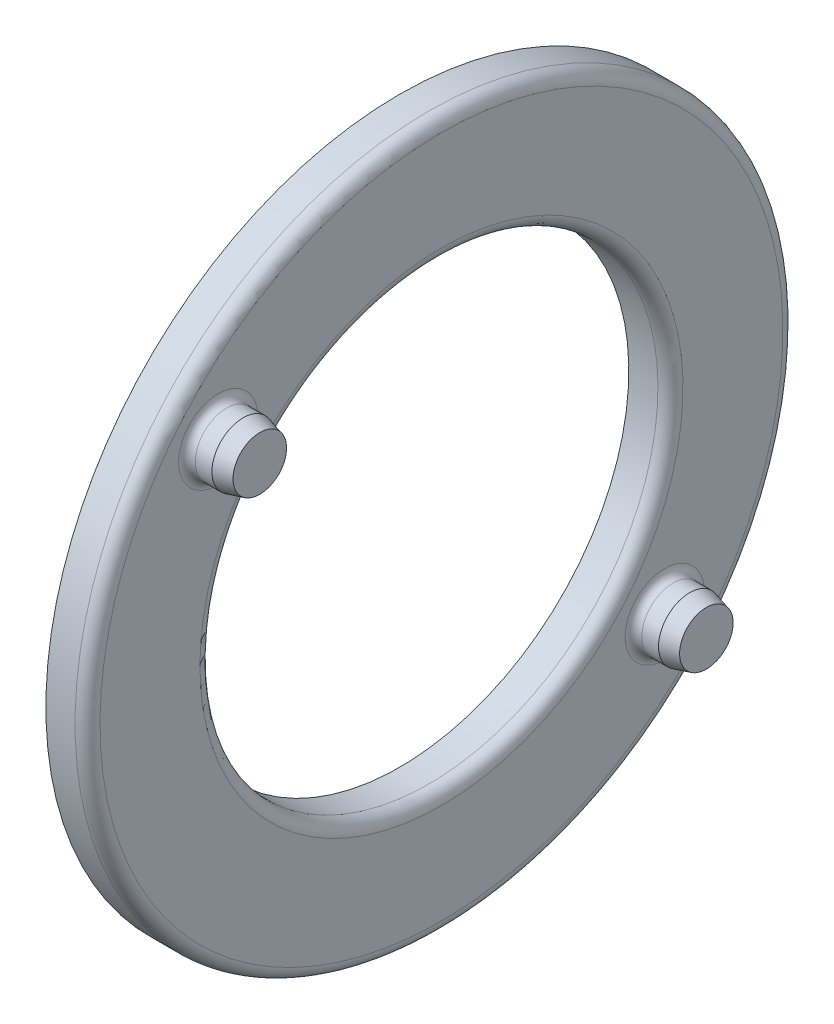
ISO-10303-21;
HEADER;
FILE_DESCRIPTION(('STEP AP214'),'2;1');
FILE_NAME('part.step','',(''),(''),'','','');
FILE_SCHEMA(('AUTOMOTIVE_DESIGN { 1 0 10303 214 1 1 1 1 }'));
ENDSEC;
DATA;
#1=APPLICATION_CONTEXT('core data for automotive mechanical design processes');
#2=APPLICATION_PROTOCOL_DEFINITION('international standard','automotive_design',2000,#1);
#3=PRODUCT_CONTEXT('',#1,'mechanical');
#4=PRODUCT('Part','Part','',(#3));
#5=PRODUCT_RELATED_PRODUCT_CATEGORY('part','',(#4));
#6=PRODUCT_DEFINITION_FORMATION('','',#4);
#7=PRODUCT_DEFINITION_CONTEXT('part definition',#1,'design');
#8=PRODUCT_DEFINITION('design','',#6,#7);
#9=PRODUCT_DEFINITION_SHAPE('','',#8);
#10=(LENGTH_UNIT() NAMED_UNIT(*) SI_UNIT(.MILLI.,.METRE.));
#11=(NAMED_UNIT(*) PLANE_ANGLE_UNIT() SI_UNIT($,.RADIAN.));
#12=(NAMED_UNIT(*) SI_UNIT($,.STERADIAN.) SOLID_ANGLE_UNIT());
#13=UNCERTAINTY_MEASURE_WITH_UNIT(LENGTH_MEASURE(1.E-05),#10,'distance_accuracy_value','');
#14=(GEOMETRIC_REPRESENTATION_CONTEXT(3) GLOBAL_UNCERTAINTY_ASSIGNED_CONTEXT((#13)) GLOBAL_UNIT_ASSIGNED_CONTEXT((#10,
#11,#12)) REPRESENTATION_CONTEXT('',''));
#15=CARTESIAN_POINT('',(0.,0.,0.));
#16=DIRECTION('',(0.,0.,1.));
#17=DIRECTION('',(1.,0.,0.));
#18=AXIS2_PLACEMENT_3D('',#15,#16,#17);
#19=CARTESIAN_POINT('',(-5.5,10.5004867321943,-5.36231110183287));
#20=DIRECTION('',(1.,0.,0.));
#21=DIRECTION('',(0.,0.,-1.));
#22=AXIS2_PLACEMENT_3D('',#19,#20,#21);
#23=PLANE('',#22);
#24=CARTESIAN_POINT('',(-5.49999999998363,10.5004867321943,-5.36231110183287));
#25=DIRECTION('',(-1.,0.,0.));
#26=DIRECTION('',(0.,0.,1.));
#27=AXIS2_PLACEMENT_3D('',#24,#25,#26);
#28=CIRCLE('',#27,0.642820323025969);
#29=CARTESIAN_POINT('',(-5.49999999998363,10.5004867321943,-4.7194907788069));
#30=VERTEX_POINT('',#29);
#31=EDGE_CURVE('E18',#30,#30,#28,.T.);
#32=ORIENTED_EDGE('',*,*,#31,.F.);
#33=EDGE_LOOP('',(#32));
#34=FACE_BOUND('',#33,.T.);
#35=ADVANCED_FACE('F15',(#34),#23,.T.);
#36=CARTESIAN_POINT('',(-5.5,19.4995132678057,5.36231110183287));
#37=DIRECTION('',(1.,0.,0.));
#38=DIRECTION('',(0.,0.,-1.));
#39=AXIS2_PLACEMENT_3D('',#36,#37,#38);
#40=PLANE('',#39);
#41=CARTESIAN_POINT('',(-5.49999999998363,19.4995132678057,5.36231110183287));
#42=DIRECTION('',(-1.,0.,0.));
#43=DIRECTION('',(0.,0.,1.));
#44=AXIS2_PLACEMENT_3D('',#41,#42,#43);
#45=CIRCLE('',#44,0.642820323032289);
#46=CARTESIAN_POINT('',(-5.49999999998363,19.4995132678057,6.00513142486516));
#47=VERTEX_POINT('',#46);
#48=EDGE_CURVE('E32',#47,#47,#45,.T.);
#49=ORIENTED_EDGE('',*,*,#48,.F.);
#50=EDGE_LOOP('',(#49));
#51=FACE_BOUND('',#50,.T.);
#52=ADVANCED_FACE('F45',(#51),#40,.T.);
#53=CARTESIAN_POINT('',(-5.89999999994006,10.5004867321943,-5.36231110183287));
#54=DIRECTION('',(-1.,0.,0.));
#55=DIRECTION('',(0.,0.,1.));
#56=AXIS2_PLACEMENT_3D('',#53,#54,#55);
#57=CONICAL_SURFACE('',#56,0.749999999979426,0.261799387782077);
#58=ORIENTED_EDGE('',*,*,#31,.T.);
#59=EDGE_LOOP('',(#58));
#60=FACE_BOUND('',#59,.T.);
#61=CARTESIAN_POINT('',(-5.9,10.5004867321943,-5.36231110183287));
#62=DIRECTION('',(1.,0.,0.));
#63=DIRECTION('',(0.,1.,0.));
#64=AXIS2_PLACEMENT_3D('',#61,#62,#63);
#65=CIRCLE('',#64,0.75);
#66=CARTESIAN_POINT('',(-5.9,11.2504867321943,-5.36231110183287));
#67=VERTEX_POINT('',#66);
#68=EDGE_CURVE('E30',#67,#67,#65,.F.);
#69=ORIENTED_EDGE('',*,*,#68,.F.);
#70=EDGE_LOOP('',(#69));
#71=FACE_BOUND('',#70,.T.);
#72=ADVANCED_FACE('F41',(#60,#71),#57,.T.);
#73=CARTESIAN_POINT('',(-5.89999999994006,19.4995132678057,5.36231110183287));
#74=DIRECTION('',(-1.,0.,0.));
#75=DIRECTION('',(0.,0.,1.));
#76=AXIS2_PLACEMENT_3D('',#73,#74,#75);
#77=CONICAL_SURFACE('',#76,0.749999999985746,0.261799387782078);
#78=ORIENTED_EDGE('',*,*,#48,.T.);
#79=EDGE_LOOP('',(#78));
#80=FACE_BOUND('',#79,.T.);
#81=CARTESIAN_POINT('',(-5.90000000000001,19.4995132678057,5.36231110183287));
#82=DIRECTION('',(1.,0.,0.));
#83=DIRECTION('',(0.,1.,0.));
#84=AXIS2_PLACEMENT_3D('',#81,#82,#83);
#85=CIRCLE('',#84,0.75);
#86=CARTESIAN_POINT('',(-5.90000000000001,20.2495132678057,5.36231110183287));
#87=VERTEX_POINT('',#86);
#88=EDGE_CURVE('E37',#87,#87,#85,.F.);
#89=ORIENTED_EDGE('',*,*,#88,.F.);
#90=EDGE_LOOP('',(#89));
#91=FACE_BOUND('',#90,.T.);
#92=ADVANCED_FACE('F202',(#80,#91),#77,.T.);
#93=CARTESIAN_POINT('',(-5.5,10.5004867321943,-5.36231110183287));
#94=DIRECTION('',(1.,0.,0.));
#95=DIRECTION('',(0.,1.,0.));
#96=AXIS2_PLACEMENT_3D('',#93,#94,#95);
#97=CYLINDRICAL_SURFACE('',#96,0.75);
#98=ORIENTED_EDGE('',*,*,#68,.T.);
#99=EDGE_LOOP('',(#98));
#100=FACE_BOUND('',#99,.T.);
#101=CARTESIAN_POINT('',(-6.3,10.5004867321943,-5.36231110183287));
#102=DIRECTION('',(1.,0.,0.));
#103=DIRECTION('',(0.,0.766044443118982,-0.642787609686535));
#104=AXIS2_PLACEMENT_3D('',#101,#102,#103);
#105=CIRCLE('',#104,0.75);
#106=CARTESIAN_POINT('',(-6.3,11.0750200645335,-5.84440180909777));
#107=VERTEX_POINT('',#106);
#108=EDGE_CURVE('E161',#107,#107,#105,.T.);
#109=ORIENTED_EDGE('',*,*,#108,.T.);
#110=EDGE_LOOP('',(#109));
#111=FACE_BOUND('',#110,.T.);
#112=ADVANCED_FACE('F199',(#100,#111),#97,.T.);
#113=CARTESIAN_POINT('',(-5.5,19.4995132678057,5.36231110183287));
#114=DIRECTION('',(1.,0.,0.));
#115=DIRECTION('',(0.,1.,0.));
#116=AXIS2_PLACEMENT_3D('',#113,#114,#115);
#117=CYLINDRICAL_SURFACE('',#116,0.75);
#118=ORIENTED_EDGE('',*,*,#88,.T.);
#119=EDGE_LOOP('',(#118));
#120=FACE_BOUND('',#119,.T.);
#121=CARTESIAN_POINT('',(-6.3,19.4995132678057,5.36231110183287));
#122=DIRECTION('',(1.,0.,0.));
#123=DIRECTION('',(0.,0.76604444311898,-0.642787609686537));
#124=AXIS2_PLACEMENT_3D('',#121,#122,#123);
#125=CIRCLE('',#124,0.749999999999999);
#126=CARTESIAN_POINT('',(-6.3,20.074046600145,4.88022039456797));
#127=VERTEX_POINT('',#126);
#128=EDGE_CURVE('E157',#127,#127,#125,.T.);
#129=ORIENTED_EDGE('',*,*,#128,.T.);
#130=EDGE_LOOP('',(#129));
#131=FACE_BOUND('',#130,.T.);
#132=ADVANCED_FACE('F181',(#120,#131),#117,.T.);
#133=CARTESIAN_POINT('',(-6.3,10.5004867321943,-5.36231110183287));
#134=DIRECTION('',(1.,0.,0.));
#135=DIRECTION('',(0.,0.766044443118982,-0.642787609686535));
#136=AXIS2_PLACEMENT_3D('',#133,#134,#135);
#137=TOROIDAL_SURFACE('',#136,0.95,0.2);
#138=CARTESIAN_POINT('',(-6.5,10.5004867321943,-5.36231110183287));
#139=DIRECTION('',(1.,0.,0.));
#140=DIRECTION('',(0.,0.766044443118981,-0.642787609686536));
#141=AXIS2_PLACEMENT_3D('',#138,#139,#140);
#142=CIRCLE('',#141,0.949999999999998);
#143=CARTESIAN_POINT('',(-6.5,11.2282289531573,-5.97295933103508));
#144=VERTEX_POINT('',#143);
#145=EDGE_CURVE('E160',#144,#144,#142,.F.);
#146=ORIENTED_EDGE('',*,*,#145,.F.);
#147=EDGE_LOOP('',(#146));
#148=FACE_BOUND('',#147,.T.);
#149=ORIENTED_EDGE('',*,*,#108,.F.);
#150=EDGE_LOOP('',(#149));
#151=FACE_BOUND('',#150,.T.);
#152=ADVANCED_FACE('F177',(#148,#151),#137,.F.);
#153=CARTESIAN_POINT('',(-6.3,19.4995132678057,5.36231110183287));
#154=DIRECTION('',(1.,0.,0.));
#155=DIRECTION('',(0.,0.766044443118982,-0.642787609686535));
#156=AXIS2_PLACEMENT_3D('',#153,#154,#155);
#157=TOROIDAL_SURFACE('',#156,0.95,0.2);
#158=CARTESIAN_POINT('',(-6.5,19.4995132678057,5.36231110183287));
#159=DIRECTION('',(1.,0.,0.));
#160=DIRECTION('',(0.,0.766044443118982,-0.642787609686535));
#161=AXIS2_PLACEMENT_3D('',#158,#159,#160);
#162=CIRCLE('',#161,0.95);
#163=CARTESIAN_POINT('',(-6.5,20.2272554887688,4.75166287263067));
#164=VERTEX_POINT('',#163);
#165=EDGE_CURVE('E165',#164,#164,#162,.F.);
#166=ORIENTED_EDGE('',*,*,#165,.F.);
#167=EDGE_LOOP('',(#166));
#168=FACE_BOUND('',#167,.T.);
#169=ORIENTED_EDGE('',*,*,#128,.F.);
#170=EDGE_LOOP('',(#169));
#171=FACE_BOUND('',#170,.T.);
#172=ADVANCED_FACE('F105',(#168,#171),#157,.F.);
#173=CARTESIAN_POINT('',(-6.5,15.,0.));
#174=DIRECTION('',(1.,0.,0.));
#175=DIRECTION('',(0.,0.,-1.));
#176=AXIS2_PLACEMENT_3D('',#173,#174,#175);
#177=PLANE('',#176);
#178=CARTESIAN_POINT('',(-6.5,15.,0.));
#179=DIRECTION('',(1.,0.,0.));
#180=DIRECTION('',(0.,0.766044443118982,-0.642787609686535));
#181=AXIS2_PLACEMENT_3D('',#178,#179,#180);
#182=CIRCLE('',#181,5.8);
#183=CARTESIAN_POINT('',(-6.5,19.4430577700901,-3.7281681361819));
#184=VERTEX_POINT('',#183);
#185=EDGE_CURVE('E85',#184,#184,#182,.T.);
#186=ORIENTED_EDGE('',*,*,#185,.F.);
#187=EDGE_LOOP('',(#186));
#188=FACE_BOUND('',#187,.T.);
#189=ORIENTED_EDGE('',*,*,#165,.T.);
#190=EDGE_LOOP('',(#189));
#191=FACE_BOUND('',#190,.T.);
#192=ORIENTED_EDGE('',*,*,#145,.T.);
#193=EDGE_LOOP('',(#192));
#194=FACE_BOUND('',#193,.T.);
#195=CARTESIAN_POINT('',(-6.5,15.,0.));
#196=DIRECTION('',(-1.,0.,0.));
#197=DIRECTION('',(0.,0.766044443118982,-0.642787609686535));
#198=AXIS2_PLACEMENT_3D('',#195,#196,#197);
#199=CIRCLE('',#198,8.2);
#200=CARTESIAN_POINT('',(-6.5,21.2815644335756,-5.27085839942959));
#201=VERTEX_POINT('',#200);
#202=EDGE_CURVE('E90',#201,#201,#199,.T.);
#203=ORIENTED_EDGE('',*,*,#202,.F.);
#204=EDGE_LOOP('',(#203));
#205=FACE_BOUND('',#204,.T.);
#206=ADVANCED_FACE('F96',(#188,#191,#194,#205),#177,.T.);
#207=CARTESIAN_POINT('',(-6.8,15.,0.));
#208=DIRECTION('',(1.,0.,0.));
#209=DIRECTION('',(0.,0.766044443118982,-0.642787609686535));
#210=AXIS2_PLACEMENT_3D('',#207,#208,#209);
#211=TOROIDAL_SURFACE('',#210,8.2,0.3);
#212=ORIENTED_EDGE('',*,*,#202,.T.);
#213=EDGE_LOOP('',(#212));
#214=FACE_BOUND('',#213,.T.);
#215=CARTESIAN_POINT('',(-6.8,15.,0.));
#216=DIRECTION('',(1.,0.,0.));
#217=DIRECTION('',(0.,1.,0.));
#218=AXIS2_PLACEMENT_3D('',#215,#216,#217);
#219=CIRCLE('',#218,8.5);
#220=CARTESIAN_POINT('',(-6.8,23.5,0.));
#221=VERTEX_POINT('',#220);
#222=EDGE_CURVE('E82',#221,#221,#219,.F.);
#223=ORIENTED_EDGE('',*,*,#222,.F.);
#224=EDGE_LOOP('',(#223));
#225=FACE_BOUND('',#224,.T.);
#226=ADVANCED_FACE('F72',(#214,#225),#211,.T.);
#227=CARTESIAN_POINT('',(-6.8,15.,0.));
#228=DIRECTION('',(1.,0.,0.));
#229=DIRECTION('',(0.,0.766044443118982,-0.642787609686535));
#230=AXIS2_PLACEMENT_3D('',#227,#228,#229);
#231=TOROIDAL_SURFACE('',#230,5.8,0.3);
#232=CARTESIAN_POINT('',(-6.8,15.,0.));
#233=DIRECTION('',(1.,0.,0.));
#234=DIRECTION('',(0.,1.,0.));
#235=AXIS2_PLACEMENT_3D('',#232,#233,#234);
#236=CIRCLE('',#235,5.5);
#237=CARTESIAN_POINT('',(-6.8,20.5,0.));
#238=VERTEX_POINT('',#237);
#239=EDGE_CURVE('E27',#238,#238,#236,.F.);
#240=ORIENTED_EDGE('',*,*,#239,.T.);
#241=EDGE_LOOP('',(#240));
#242=FACE_BOUND('',#241,.T.);
#243=ORIENTED_EDGE('',*,*,#185,.T.);
#244=EDGE_LOOP('',(#243));
#245=FACE_BOUND('',#244,.T.);
#246=ADVANCED_FACE('F66',(#242,#245),#231,.T.);
#247=CARTESIAN_POINT('',(-6.5,15.,0.));
#248=DIRECTION('',(1.,0.,0.));
#249=DIRECTION('',(0.,1.,0.));
#250=AXIS2_PLACEMENT_3D('',#247,#248,#249);
#251=CYLINDRICAL_SURFACE('',#250,8.5);
#252=CARTESIAN_POINT('',(-7.5,15.,0.));
#253=DIRECTION('',(1.,0.,0.));
#254=DIRECTION('',(0.,1.,0.));
#255=AXIS2_PLACEMENT_3D('',#252,#253,#254);
#256=CIRCLE('',#255,8.5);
#257=CARTESIAN_POINT('',(-7.5,23.5,0.));
#258=VERTEX_POINT('',#257);
#259=EDGE_CURVE('E22',#258,#258,#256,.T.);
#260=ORIENTED_EDGE('',*,*,#259,.T.);
#261=EDGE_LOOP('',(#260));
#262=FACE_BOUND('',#261,.T.);
#263=ORIENTED_EDGE('',*,*,#222,.T.);
#264=EDGE_LOOP('',(#263));
#265=FACE_BOUND('',#264,.T.);
#266=ADVANCED_FACE('F59',(#262,#265),#251,.T.);
#267=CARTESIAN_POINT('',(-6.5,15.,0.));
#268=DIRECTION('',(1.,0.,0.));
#269=DIRECTION('',(0.,1.,0.));
#270=AXIS2_PLACEMENT_3D('',#267,#268,#269);
#271=CYLINDRICAL_SURFACE('',#270,5.5);
#272=ORIENTED_EDGE('',*,*,#239,.F.);
#273=EDGE_LOOP('',(#272));
#274=FACE_BOUND('',#273,.T.);
#275=CARTESIAN_POINT('',(-7.5,15.,0.));
#276=DIRECTION('',(1.,0.,0.));
#277=DIRECTION('',(0.,1.,0.));
#278=AXIS2_PLACEMENT_3D('',#275,#276,#277);
#279=CIRCLE('',#278,5.5);
#280=CARTESIAN_POINT('',(-7.5,20.5,0.));
#281=VERTEX_POINT('',#280);
#282=EDGE_CURVE('E10',#281,#281,#279,.F.);
#283=ORIENTED_EDGE('',*,*,#282,.T.);
#284=EDGE_LOOP('',(#283));
#285=FACE_BOUND('',#284,.T.);
#286=ADVANCED_FACE('F53',(#274,#285),#271,.F.);
#287=CARTESIAN_POINT('',(-7.5,15.,0.));
#288=DIRECTION('',(1.,0.,0.));
#289=DIRECTION('',(0.,0.,-1.));
#290=AXIS2_PLACEMENT_3D('',#287,#288,#289);
#291=PLANE('',#290);
#292=ORIENTED_EDGE('',*,*,#282,.F.);
#293=EDGE_LOOP('',(#292));
#294=FACE_BOUND('',#293,.T.);
#295=ORIENTED_EDGE('',*,*,#259,.F.);
#296=EDGE_LOOP('',(#295));
#297=FACE_BOUND('',#296,.T.);
#298=ADVANCED_FACE('F51',(#294,#297),#291,.F.);
#299=CLOSED_SHELL('',(#35,#52,#72,#92,#112,#132,#152,#172,#206,#226,#246,#266,#286,#298));
#300=MANIFOLD_SOLID_BREP('B1',#299);
#301=ADVANCED_BREP_SHAPE_REPRESENTATION('',(#18,#300),#14);
#302=SHAPE_DEFINITION_REPRESENTATION(#9,#301);
ENDSEC;
END-ISO-10303-21;
